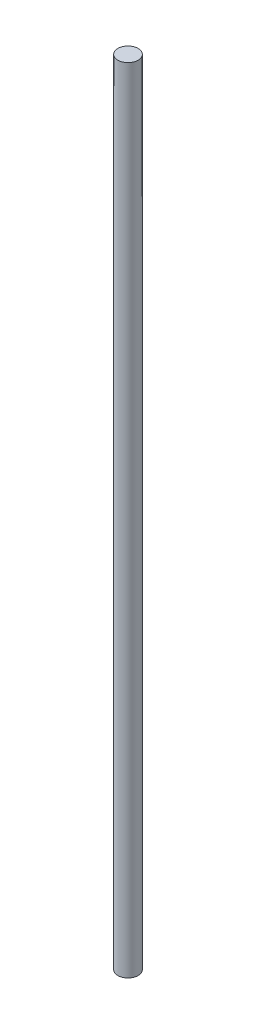
ISO-10303-21;
HEADER;
FILE_DESCRIPTION(('STEP AP214'),'2;1');
FILE_NAME('part.step','',(''),(''),'','','');
FILE_SCHEMA(('AUTOMOTIVE_DESIGN { 1 0 10303 214 1 1 1 1 }'));
ENDSEC;
DATA;
#1=APPLICATION_CONTEXT('core data for automotive mechanical design processes');
#2=APPLICATION_PROTOCOL_DEFINITION('international standard','automotive_design',2000,#1);
#3=PRODUCT_CONTEXT('',#1,'mechanical');
#4=PRODUCT('Part','Part','',(#3));
#5=PRODUCT_RELATED_PRODUCT_CATEGORY('part','',(#4));
#6=PRODUCT_DEFINITION_FORMATION('','',#4);
#7=PRODUCT_DEFINITION_CONTEXT('part definition',#1,'design');
#8=PRODUCT_DEFINITION('design','',#6,#7);
#9=PRODUCT_DEFINITION_SHAPE('','',#8);
#10=(LENGTH_UNIT() NAMED_UNIT(*) SI_UNIT(.MILLI.,.METRE.));
#11=(NAMED_UNIT(*) PLANE_ANGLE_UNIT() SI_UNIT($,.RADIAN.));
#12=(NAMED_UNIT(*) SI_UNIT($,.STERADIAN.) SOLID_ANGLE_UNIT());
#13=UNCERTAINTY_MEASURE_WITH_UNIT(LENGTH_MEASURE(1.E-05),#10,'distance_accuracy_value','');
#14=(GEOMETRIC_REPRESENTATION_CONTEXT(3) GLOBAL_UNCERTAINTY_ASSIGNED_CONTEXT((#13)) GLOBAL_UNIT_ASSIGNED_CONTEXT((#10,
#11,#12)) REPRESENTATION_CONTEXT('',''));
#15=CARTESIAN_POINT('',(0.,0.,0.));
#16=DIRECTION('',(0.,0.,1.));
#17=DIRECTION('',(1.,0.,0.));
#18=AXIS2_PLACEMENT_3D('',#15,#16,#17);
#19=CARTESIAN_POINT('',(0.,390.,0.));
#20=DIRECTION('',(0.,-1.,0.));
#21=DIRECTION('',(0.,0.,-1.));
#22=AXIS2_PLACEMENT_3D('',#19,#20,#21);
#23=CYLINDRICAL_SURFACE('',#22,5.);
#24=CARTESIAN_POINT('',(0.,390.,0.));
#25=DIRECTION('',(0.,1.,0.));
#26=DIRECTION('',(0.,0.,1.));
#27=AXIS2_PLACEMENT_3D('',#24,#25,#26);
#28=CIRCLE('',#27,5.);
#29=CARTESIAN_POINT('',(0.,390.,5.));
#30=VERTEX_POINT('',#29);
#31=EDGE_CURVE('E10',#30,#30,#28,.T.);
#32=ORIENTED_EDGE('',*,*,#31,.F.);
#33=EDGE_LOOP('',(#32));
#34=FACE_BOUND('',#33,.T.);
#35=CARTESIAN_POINT('',(0.,0.,0.));
#36=DIRECTION('',(0.,1.,0.));
#37=DIRECTION('',(0.,0.,1.));
#38=AXIS2_PLACEMENT_3D('',#35,#36,#37);
#39=CIRCLE('',#38,5.);
#40=CARTESIAN_POINT('',(0.,0.,5.));
#41=VERTEX_POINT('',#40);
#42=EDGE_CURVE('E39',#41,#41,#39,.T.);
#43=ORIENTED_EDGE('',*,*,#42,.T.);
#44=EDGE_LOOP('',(#43));
#45=FACE_BOUND('',#44,.T.);
#46=ADVANCED_FACE('F36',(#34,#45),#23,.T.);
#47=CARTESIAN_POINT('',(0.,390.,0.));
#48=DIRECTION('',(0.,1.,0.));
#49=DIRECTION('',(0.,0.,1.));
#50=AXIS2_PLACEMENT_3D('',#47,#48,#49);
#51=PLANE('',#50);
#52=ORIENTED_EDGE('',*,*,#31,.T.);
#53=EDGE_LOOP('',(#52));
#54=FACE_BOUND('',#53,.T.);
#55=ADVANCED_FACE('F51',(#54),#51,.T.);
#56=CARTESIAN_POINT('',(0.,0.,0.));
#57=DIRECTION('',(0.,1.,0.));
#58=DIRECTION('',(0.,0.,1.));
#59=AXIS2_PLACEMENT_3D('',#56,#57,#58);
#60=PLANE('',#59);
#61=ORIENTED_EDGE('',*,*,#42,.F.);
#62=EDGE_LOOP('',(#61));
#63=FACE_BOUND('',#62,.T.);
#64=ADVANCED_FACE('F49',(#63),#60,.F.);
#65=CLOSED_SHELL('',(#46,#55,#64));
#66=MANIFOLD_SOLID_BREP('B2',#65);
#67=ADVANCED_BREP_SHAPE_REPRESENTATION('',(#18,#66),#14);
#68=SHAPE_DEFINITION_REPRESENTATION(#9,#67);
ENDSEC;
END-ISO-10303-21;
